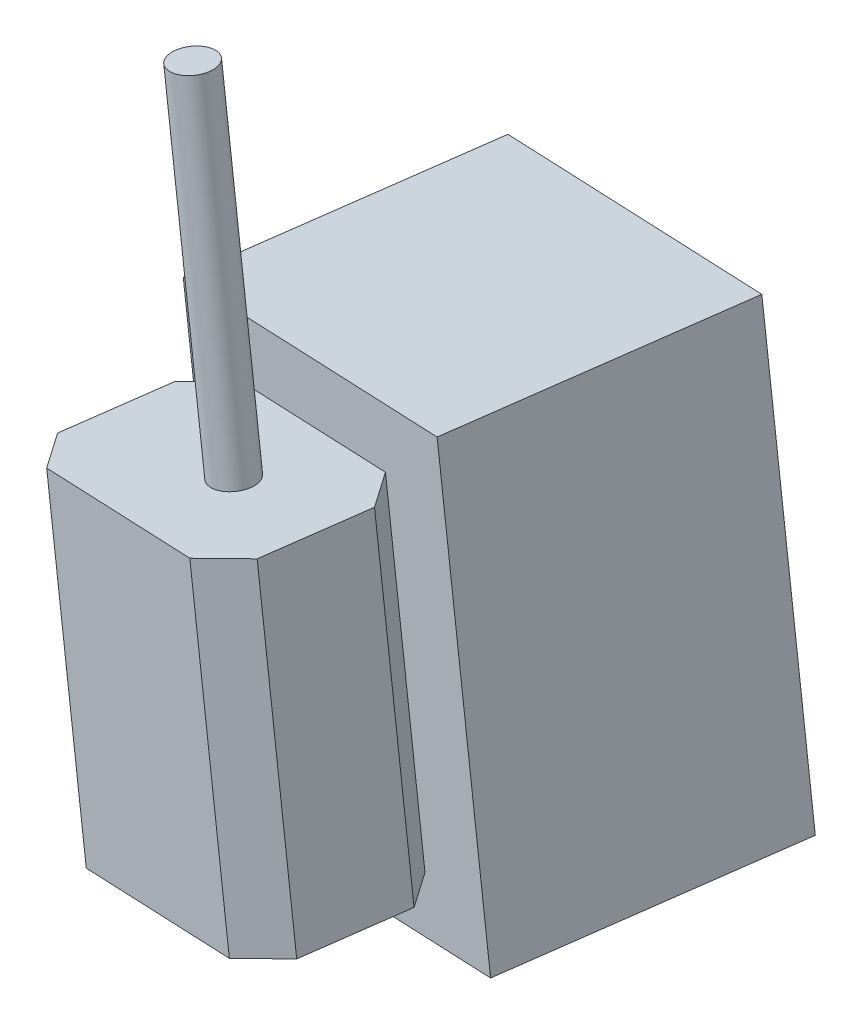
ISO-10303-21;
HEADER;
FILE_DESCRIPTION(('STEP AP214'),'2;1');
FILE_NAME('part.step','',(''),(''),'','','');
FILE_SCHEMA(('AUTOMOTIVE_DESIGN { 1 0 10303 214 1 1 1 1 }'));
ENDSEC;
DATA;
#1=APPLICATION_CONTEXT('core data for automotive mechanical design processes');
#2=APPLICATION_PROTOCOL_DEFINITION('international standard','automotive_design',2000,#1);
#3=PRODUCT_CONTEXT('',#1,'mechanical');
#4=PRODUCT('Part','Part','',(#3));
#5=PRODUCT_RELATED_PRODUCT_CATEGORY('part','',(#4));
#6=PRODUCT_DEFINITION_FORMATION('','',#4);
#7=PRODUCT_DEFINITION_CONTEXT('part definition',#1,'design');
#8=PRODUCT_DEFINITION('design','',#6,#7);
#9=PRODUCT_DEFINITION_SHAPE('','',#8);
#10=(LENGTH_UNIT() NAMED_UNIT(*) SI_UNIT(.MILLI.,.METRE.));
#11=(NAMED_UNIT(*) PLANE_ANGLE_UNIT() SI_UNIT($,.RADIAN.));
#12=(NAMED_UNIT(*) SI_UNIT($,.STERADIAN.) SOLID_ANGLE_UNIT());
#13=UNCERTAINTY_MEASURE_WITH_UNIT(LENGTH_MEASURE(1.E-05),#10,'distance_accuracy_value','');
#14=(GEOMETRIC_REPRESENTATION_CONTEXT(3) GLOBAL_UNCERTAINTY_ASSIGNED_CONTEXT((#13)) GLOBAL_UNIT_ASSIGNED_CONTEXT((#10,
#11,#12)) REPRESENTATION_CONTEXT('',''));
#15=CARTESIAN_POINT('',(0.,0.,0.));
#16=DIRECTION('',(0.,0.,1.));
#17=DIRECTION('',(1.,0.,0.));
#18=AXIS2_PLACEMENT_3D('',#15,#16,#17);
#19=CARTESIAN_POINT('',(103.63472226513,12.5411793974475,-659.097502521401));
#20=DIRECTION('',(-0.155301463699256,-0.0187935421099099,0.987688340595267));
#21=DIRECTION('',(0.987862811204078,0.,0.155328896989503));
#22=AXIS2_PLACEMENT_3D('',#19,#20,#21);
#23=PLANE('',#22);
#24=DIRECTION('',(-0.120136838837569,0.992757341929092,1.46464037480119E-12));
#25=VECTOR('',#24,1.);
#26=CARTESIAN_POINT('',(-916.89912909739,-433.291545399684,-828.046724799583));
#27=LINE('',#26,#25);
#28=CARTESIAN_POINT('',(-916.899129102622,-433.291545397673,-828.046724781075));
#29=VERTEX_POINT('',#28);
#30=CARTESIAN_POINT('',(-948.134707199529,-175.174636494789,-828.046724790618));
#31=VERTEX_POINT('',#30);
#32=EDGE_CURVE('E112',#29,#31,#27,.T.);
#33=ORIENTED_EDGE('',*,*,#32,.T.);
#34=DIRECTION('',(0.980534851673853,0.118657754963437,0.156434465000434));
#35=VECTOR('',#34,1.);
#36=CARTESIAN_POINT('',(-948.134707202459,-175.174636479681,-828.0467248));
#37=LINE('',#36,#35);
#38=CARTESIAN_POINT('',(-771.638433902464,-153.816240593359,-799.888521089255));
#39=VERTEX_POINT('',#38);
#40=EDGE_CURVE('E109',#31,#39,#37,.T.);
#41=ORIENTED_EDGE('',*,*,#40,.T.);
#42=DIRECTION('',(0.120136838837569,-0.992757341929092,-1.46421336594556E-12));
#43=VECTOR('',#42,1.);
#44=CARTESIAN_POINT('',(-771.638433899792,-153.816240599975,-799.888521099967));
#45=LINE('',#44,#43);
#46=CARTESIAN_POINT('',(-740.402855802959,-411.933149499398,-799.888521089009));
#47=VERTEX_POINT('',#46);
#48=EDGE_CURVE('E134',#39,#47,#45,.T.);
#49=ORIENTED_EDGE('',*,*,#48,.T.);
#50=DIRECTION('',(-0.980534851673853,-0.118657754963438,-0.156434465000434));
#51=VECTOR('',#50,1.);
#52=CARTESIAN_POINT('',(-740.402855800458,-411.933149496217,-799.8885211));
#53=LINE('',#52,#51);
#54=EDGE_CURVE('E114',#47,#29,#53,.T.);
#55=ORIENTED_EDGE('',*,*,#54,.T.);
#56=EDGE_LOOP('',(#33,#41,#49,#55));
#57=FACE_BOUND('',#56,.T.);
#58=ADVANCED_FACE('F25',(#57),#23,.F.);
#59=CARTESIAN_POINT('',(-1058.97763977266,-128.150375392334,-168.949222189894));
#60=DIRECTION('',(0.980534851670674,0.118657754996451,0.156434464995321));
#61=DIRECTION('',(0.157547504560289,0.,-0.987511409456532));
#62=AXIS2_PLACEMENT_3D('',#59,#60,#61);
#63=PLANE('',#62);
#64=DIRECTION('',(0.155301463898073,0.0187935421338904,-0.987688340563549));
#65=VECTOR('',#64,1.);
#66=CARTESIAN_POINT('',(-973.913542102792,-178.294218276927,-664.0981436));
#67=LINE('',#66,#65);
#68=CARTESIAN_POINT('',(-973.913542075847,-178.294218291224,-664.0981436105));
#69=VERTEX_POINT('',#68);
#70=EDGE_CURVE('E119',#69,#31,#67,.T.);
#71=ORIENTED_EDGE('',*,*,#70,.T.);
#72=ORIENTED_EDGE('',*,*,#32,.F.);
#73=DIRECTION('',(-0.155301463898073,-0.0187935421338904,0.987688340563549));
#74=VECTOR('',#73,1.);
#75=CARTESIAN_POINT('',(-916.899129101261,-433.291545389576,-828.0467248));
#76=LINE('',#75,#74);
#77=CARTESIAN_POINT('',(-942.677963976808,-436.411127193851,-664.098143610263));
#78=VERTEX_POINT('',#77);
#79=EDGE_CURVE('E140',#29,#78,#76,.T.);
#80=ORIENTED_EDGE('',*,*,#79,.T.);
#81=DIRECTION('',(-0.120136838845713,0.992757341928106,-6.57380133238028E-12));
#82=VECTOR('',#81,1.);
#83=CARTESIAN_POINT('',(-942.677963991393,-436.411127198958,-664.098143654735));
#84=LINE('',#83,#82);
#85=EDGE_CURVE('E130',#78,#69,#84,.T.);
#86=ORIENTED_EDGE('',*,*,#85,.T.);
#87=EDGE_LOOP('',(#71,#72,#80,#86));
#88=FACE_BOUND('',#87,.T.);
#89=ADVANCED_FACE('F129',(#88),#63,.F.);
#90=CARTESIAN_POINT('',(7.20821032848143,-59.5654405179783,0.));
#91=DIRECTION('',(0.120136838804012,-0.992757341933153,0.));
#92=DIRECTION('',(0.992757341933153,0.120136838804012,0.));
#93=AXIS2_PLACEMENT_3D('',#90,#91,#92);
#94=PLANE('',#93);
#95=DIRECTION('',(0.155301463653482,0.0187935421211286,-0.987688340602251));
#96=VECTOR('',#95,1.);
#97=CARTESIAN_POINT('',(-797.417268759525,-156.935822395102,-635.939939893543));
#98=LINE('',#97,#96);
#99=CARTESIAN_POINT('',(-797.417268788932,-156.935822390324,-635.939939910742));
#100=VERTEX_POINT('',#99);
#101=EDGE_CURVE('E126',#100,#39,#98,.T.);
#102=ORIENTED_EDGE('',*,*,#101,.T.);
#103=ORIENTED_EDGE('',*,*,#40,.F.);
#104=ORIENTED_EDGE('',*,*,#70,.F.);
#105=DIRECTION('',(0.980534851663259,0.118657754999587,0.156434465039416));
#106=VECTOR('',#105,1.);
#107=CARTESIAN_POINT('',(-973.913542091125,-178.294218298926,-664.098143656444));
#108=LINE('',#107,#106);
#109=EDGE_CURVE('E143',#69,#100,#108,.T.);
#110=ORIENTED_EDGE('',*,*,#109,.T.);
#111=EDGE_LOOP('',(#102,#103,#104,#110));
#112=FACE_BOUND('',#111,.T.);
#113=ADVANCED_FACE('F123',(#112),#94,.F.);
#114=CARTESIAN_POINT('',(-882.481366477213,-106.791979493612,-140.791018491578));
#115=DIRECTION('',(-0.980534851670674,-0.118657754996451,-0.156434464995321));
#116=DIRECTION('',(-0.157547504560289,0.,0.987511409456532));
#117=AXIS2_PLACEMENT_3D('',#114,#115,#116);
#118=PLANE('',#117);
#119=DIRECTION('',(0.155301463898072,0.0187935421338904,-0.987688340563549));
#120=VECTOR('',#119,1.);
#121=CARTESIAN_POINT('',(-766.181690700791,-415.052731293462,-635.9399399));
#122=LINE('',#121,#120);
#123=CARTESIAN_POINT('',(-766.181690679278,-415.052731295834,-635.939939908891));
#124=VERTEX_POINT('',#123);
#125=EDGE_CURVE('E136',#124,#47,#122,.T.);
#126=ORIENTED_EDGE('',*,*,#125,.T.);
#127=ORIENTED_EDGE('',*,*,#48,.F.);
#128=ORIENTED_EDGE('',*,*,#101,.F.);
#129=DIRECTION('',(0.120136838845713,-0.992757341928106,6.57337432352466E-12));
#130=VECTOR('',#129,1.);
#131=CARTESIAN_POINT('',(-797.417268792228,-156.935822399059,-635.939939949427));
#132=LINE('',#131,#130);
#133=EDGE_CURVE('E145',#100,#124,#132,.T.);
#134=ORIENTED_EDGE('',*,*,#133,.T.);
#135=EDGE_LOOP('',(#126,#127,#128,#134));
#136=FACE_BOUND('',#135,.T.);
#137=ADVANCED_FACE('F273',(#136),#118,.F.);
#138=CARTESIAN_POINT('',(38.4437884185676,-317.682349429218,0.));
#139=DIRECTION('',(-0.120136838804012,0.992757341933153,0.));
#140=DIRECTION('',(-0.992757341933153,-0.120136838804012,0.));
#141=AXIS2_PLACEMENT_3D('',#138,#139,#140);
#142=PLANE('',#141);
#143=ORIENTED_EDGE('',*,*,#79,.F.);
#144=ORIENTED_EDGE('',*,*,#54,.F.);
#145=ORIENTED_EDGE('',*,*,#125,.F.);
#146=DIRECTION('',(-0.980534851663259,-0.118657754999587,-0.156434465039415));
#147=VECTOR('',#146,1.);
#148=CARTESIAN_POINT('',(-766.181690692497,-415.052731299092,-635.939939947718));
#149=LINE('',#148,#147);
#150=EDGE_CURVE('E148',#124,#78,#149,.T.);
#151=ORIENTED_EDGE('',*,*,#150,.T.);
#152=EDGE_LOOP('',(#143,#144,#145,#151));
#153=FACE_BOUND('',#152,.T.);
#154=ADVANCED_FACE('F269',(#153),#142,.F.);
#155=CARTESIAN_POINT('',(34.4880430154643,-284.993830812911,0.));
#156=DIRECTION('',(-0.120136838804012,0.992757341933153,0.));
#157=DIRECTION('',(-0.992757341933153,-0.120136838804012,0.));
#158=AXIS2_PLACEMENT_3D('',#155,#156,#157);
#159=PLANE('',#158);
#160=DIRECTION('',(0.98053485167719,0.118657754884467,0.156434465039415));
#161=VECTOR('',#160,1.);
#162=CARTESIAN_POINT('',(-910.522898389302,-399.352720298705,-658.337027268034));
#163=LINE('',#162,#161);
#164=CARTESIAN_POINT('',(-910.522898419045,-399.352720293857,-658.337027245724));
#165=VERTEX_POINT('',#164);
#166=CARTESIAN_POINT('',(-811.031378604011,-387.312923494248,-642.464156804594));
#167=VERTEX_POINT('',#166);
#168=EDGE_CURVE('E151',#165,#167,#163,.T.);
#169=ORIENTED_EDGE('',*,*,#168,.T.);
#170=DIRECTION('',(0.583528124543153,0.070614663432273,0.809016994367545));
#171=VECTOR('',#170,1.);
#172=CARTESIAN_POINT('',(-811.031378618033,-387.312923502182,-642.464156786802));
#173=LINE('',#172,#171);
#174=CARTESIAN_POINT('',(-794.526710829066,-385.315639210056,-619.58170069288));
#175=VERTEX_POINT('',#174);
#176=EDGE_CURVE('E156',#167,#175,#173,.T.);
#177=ORIENTED_EDGE('',*,*,#176,.T.);
#178=DIRECTION('',(-0.155301463727117,-0.0187935415126332,0.987688340602251));
#179=VECTOR('',#178,1.);
#180=CARTESIAN_POINT('',(-794.526710866065,-385.315639207995,-619.58170071054));
#181=LINE('',#180,#179);
#182=CARTESIAN_POINT('',(-803.844798691422,-386.44325171124,-560.320400189304));
#183=VERTEX_POINT('',#182);
#184=EDGE_CURVE('E159',#175,#183,#181,.T.);
#185=ORIENTED_EDGE('',*,*,#184,.T.);
#186=DIRECTION('',(-0.803157560668491,-0.0971927463146037,0.587785252285956));
#187=VECTOR('',#186,1.);
#188=CARTESIAN_POINT('',(-803.844798668829,-386.443251696228,-560.320400156784));
#189=LINE('',#188,#187);
#190=CARTESIAN_POINT('',(-826.56152497985,-389.19227769498,-543.695322689953));
#191=VERTEX_POINT('',#190);
#192=EDGE_CURVE('E167',#183,#191,#189,.T.);
#193=ORIENTED_EDGE('',*,*,#192,.T.);
#194=DIRECTION('',(-0.980534851662966,-0.11865775500201,-0.156434465039415));
#195=VECTOR('',#194,1.);
#196=CARTESIAN_POINT('',(-826.561524990541,-389.192277698855,-543.695322760152));
#197=LINE('',#196,#195);
#198=CARTESIAN_POINT('',(-926.053044713327,-401.232074498019,-559.568193190342));
#199=VERTEX_POINT('',#198);
#200=EDGE_CURVE('E172',#191,#199,#197,.T.);
#201=ORIENTED_EDGE('',*,*,#200,.T.);
#202=DIRECTION('',(-0.583528124964828,-0.0706146599477659,-0.809016994367543));
#203=VECTOR('',#202,1.);
#204=CARTESIAN_POINT('',(-926.053044751439,-401.232074506225,-559.568193162354));
#205=LINE('',#204,#203);
#206=CARTESIAN_POINT('',(-942.557712507996,-403.229358712868,-582.450649290824));
#207=VERTEX_POINT('',#206);
#208=EDGE_CURVE('E177',#199,#207,#205,.T.);
#209=ORIENTED_EDGE('',*,*,#208,.T.);
#210=DIRECTION('',(0.155301463703063,0.0187935417114061,-0.987688340602251));
#211=VECTOR('',#210,1.);
#212=CARTESIAN_POINT('',(-942.557712489745,-403.229358698759,-582.450649298364));
#213=LINE('',#212,#211);
#214=CARTESIAN_POINT('',(-933.239624712489,-402.101746213345,-641.711949727354));
#215=VERTEX_POINT('',#214);
#216=EDGE_CURVE('E182',#207,#215,#213,.T.);
#217=ORIENTED_EDGE('',*,*,#216,.T.);
#218=DIRECTION('',(0.803157561090161,0.0971927428300976,-0.587785252285957));
#219=VECTOR('',#218,1.);
#220=CARTESIAN_POINT('',(-933.239624781953,-402.101746209918,-641.711949813622));
#221=LINE('',#220,#219);
#222=EDGE_CURVE('E185',#215,#165,#221,.T.);
#223=ORIENTED_EDGE('',*,*,#222,.T.);
#224=EDGE_LOOP('',(#169,#177,#185,#193,#201,#209,#217,#223));
#225=FACE_BOUND('',#224,.T.);
#226=ADVANCED_FACE('F265',(#225),#159,.F.);
#227=CARTESIAN_POINT('',(77.8558874123235,9.42159760594014,-495.148921408512));
#228=DIRECTION('',(-0.155301463699256,-0.0187935421099099,0.987688340595267));
#229=DIRECTION('',(0.987862811204078,0.,0.155328896989503));
#230=AXIS2_PLACEMENT_3D('',#227,#228,#229);
#231=PLANE('',#230);
#232=DIRECTION('',(0.12013683883695,-0.992757341929167,-3.00419347845317E-12));
#233=VECTOR('',#232,1.);
#234=CARTESIAN_POINT('',(-834.135838418822,-196.387955602278,-642.464156786225));
#235=LINE('',#234,#233);
#236=CARTESIAN_POINT('',(-834.135838403622,-196.387955598558,-642.464156804873));
#237=VERTEX_POINT('',#236);
#238=EDGE_CURVE('E153',#237,#167,#235,.T.);
#239=ORIENTED_EDGE('',*,*,#238,.T.);
#240=ORIENTED_EDGE('',*,*,#168,.F.);
#241=DIRECTION('',(-0.12013683883051,0.992757341929946,3.23972594179077E-12));
#242=VECTOR('',#241,1.);
#243=CARTESIAN_POINT('',(-910.522898482848,-399.352720310026,-658.337027314862));
#244=LINE('',#243,#242);
#245=CARTESIAN_POINT('',(-933.627358215168,-208.427752401969,-658.337027263001));
#246=VERTEX_POINT('',#245);
#247=EDGE_CURVE('E188',#165,#246,#244,.T.);
#248=ORIENTED_EDGE('',*,*,#247,.T.);
#249=DIRECTION('',(0.980534851748689,0.118657754972493,0.156434464524487));
#250=VECTOR('',#249,1.);
#251=CARTESIAN_POINT('',(-933.627358199937,-208.427752400524,-658.3370272));
#252=LINE('',#251,#250);
#253=EDGE_CURVE('E192',#246,#237,#252,.T.);
#254=ORIENTED_EDGE('',*,*,#253,.T.);
#255=EDGE_LOOP('',(#239,#240,#248,#254));
#256=FACE_BOUND('',#255,.T.);
#257=ORIENTED_EDGE('',*,*,#133,.F.);
#258=ORIENTED_EDGE('',*,*,#109,.F.);
#259=ORIENTED_EDGE('',*,*,#85,.F.);
#260=ORIENTED_EDGE('',*,*,#150,.F.);
#261=EDGE_LOOP('',(#257,#258,#259,#260));
#262=FACE_BOUND('',#261,.T.);
#263=ADVANCED_FACE('F261',(#256,#262),#231,.T.);
#264=CARTESIAN_POINT('',(-250.10248805411,-30.2657266097262,183.035759355874));
#265=DIRECTION('',(-0.803157560903636,-0.0971927442704401,0.587785252302661));
#266=DIRECTION('',(0.590581313552521,0.,0.806978136062297));
#267=AXIS2_PLACEMENT_3D('',#264,#265,#266);
#268=PLANE('',#267);
#269=ORIENTED_EDGE('',*,*,#176,.F.);
#270=ORIENTED_EDGE('',*,*,#238,.F.);
#271=DIRECTION('',(0.583528125675088,0.0706146622248362,0.809016993656494));
#272=VECTOR('',#271,1.);
#273=CARTESIAN_POINT('',(-834.135838400897,-196.387955592587,-642.4641568));
#274=LINE('',#273,#272);
#275=CARTESIAN_POINT('',(-817.631170639042,-194.390671387351,-619.581700685261));
#276=VERTEX_POINT('',#275);
#277=EDGE_CURVE('E195',#237,#276,#274,.T.);
#278=ORIENTED_EDGE('',*,*,#277,.T.);
#279=DIRECTION('',(0.120136838838746,-0.992757341928949,-8.95254275324776E-12));
#280=VECTOR('',#279,1.);
#281=CARTESIAN_POINT('',(-817.631170655273,-194.390671406689,-619.581700708818));
#282=LINE('',#281,#280);
#283=EDGE_CURVE('E161',#276,#175,#282,.T.);
#284=ORIENTED_EDGE('',*,*,#283,.T.);
#285=EDGE_LOOP('',(#269,#270,#278,#284));
#286=FACE_BOUND('',#285,.T.);
#287=ADVANCED_FACE('F257',(#286),#268,.F.);
#288=CARTESIAN_POINT('',(-903.764612009869,-109.367535201439,-144.18654606777));
#289=DIRECTION('',(-0.980534851670674,-0.118657754996451,-0.156434464995321));
#290=DIRECTION('',(-0.157547504560289,0.,0.987511409456532));
#291=AXIS2_PLACEMENT_3D('',#288,#289,#290);
#292=PLANE('',#291);
#293=DIRECTION('',(-0.155301463131534,-0.0187935420411293,0.987688340685843));
#294=VECTOR('',#293,1.);
#295=CARTESIAN_POINT('',(-817.631170608289,-194.390671331507,-619.5817007));
#296=LINE('',#295,#294);
#297=CARTESIAN_POINT('',(-826.949258444291,-195.518283893969,-560.320400206331));
#298=VERTEX_POINT('',#297);
#299=EDGE_CURVE('E198',#276,#298,#296,.T.);
#300=ORIENTED_EDGE('',*,*,#299,.T.);
#301=DIRECTION('',(0.120136838535684,-0.992757341965624,2.12526483732818E-10));
#302=VECTOR('',#301,1.);
#303=CARTESIAN_POINT('',(-826.949258398309,-195.518283899795,-560.320400197656));
#304=LINE('',#303,#302);
#305=EDGE_CURVE('E164',#298,#183,#304,.T.);
#306=ORIENTED_EDGE('',*,*,#305,.T.);
#307=ORIENTED_EDGE('',*,*,#184,.F.);
#308=ORIENTED_EDGE('',*,*,#283,.F.);
#309=EDGE_LOOP('',(#300,#306,#307,#308));
#310=FACE_BOUND('',#309,.T.);
#311=ADVANCED_FACE('F253',(#310),#292,.F.);
#312=CARTESIAN_POINT('',(-554.155264124123,-67.0601554265484,-768.293775802365));
#313=DIRECTION('',(0.583528124685345,0.0706146621182265,0.809016994379682));
#314=DIRECTION('',(0.811041622795911,0.,-0.584988449537745));
#315=AXIS2_PLACEMENT_3D('',#312,#313,#314);
#316=PLANE('',#315);
#317=DIRECTION('',(0.120136838832154,-0.992757341929747,4.40988354763716E-12));
#318=VECTOR('',#317,1.);
#319=CARTESIAN_POINT('',(-849.665984790408,-198.267309798839,-543.695322761));
#320=LINE('',#319,#318);
#321=CARTESIAN_POINT('',(-849.665984779073,-198.267309799243,-543.695322689854));
#322=VERTEX_POINT('',#321);
#323=EDGE_CURVE('E169',#322,#191,#320,.T.);
#324=ORIENTED_EDGE('',*,*,#323,.T.);
#325=ORIENTED_EDGE('',*,*,#192,.F.);
#326=ORIENTED_EDGE('',*,*,#305,.F.);
#327=DIRECTION('',(-0.803157562154612,-0.0971927443930087,0.587785250573044));
#328=VECTOR('',#327,1.);
#329=CARTESIAN_POINT('',(-826.949258405434,-195.518283855094,-560.3204002));
#330=LINE('',#329,#328);
#331=EDGE_CURVE('E201',#298,#322,#330,.T.);
#332=ORIENTED_EDGE('',*,*,#331,.T.);
#333=EDGE_LOOP('',(#324,#325,#326,#332));
#334=FACE_BOUND('',#333,.T.);
#335=ADVANCED_FACE('F249',(#334),#316,.T.);
#336=CARTESIAN_POINT('',(62.3257410424723,7.54224339495815,-396.380087349459));
#337=DIRECTION('',(-0.155301463699256,-0.0187935421099099,0.987688340595267));
#338=DIRECTION('',(0.987862811204078,0.,0.155328896989503));
#339=AXIS2_PLACEMENT_3D('',#336,#337,#338);
#340=PLANE('',#339);
#341=ORIENTED_EDGE('',*,*,#323,.F.);
#342=DIRECTION('',(-0.980534851573747,-0.118657754951323,-0.156434465637087));
#343=VECTOR('',#342,1.);
#344=CARTESIAN_POINT('',(-849.665984799153,-198.267309806998,-543.6953227));
#345=LINE('',#344,#343);
#346=CARTESIAN_POINT('',(-949.157504512938,-210.307106602329,-559.568193190622));
#347=VERTEX_POINT('',#346);
#348=EDGE_CURVE('E204',#322,#347,#345,.T.);
#349=ORIENTED_EDGE('',*,*,#348,.T.);
#350=DIRECTION('',(0.120136838836951,-0.992757341929167,-3.00361619300381E-12));
#351=VECTOR('',#350,1.);
#352=CARTESIAN_POINT('',(-949.157504552228,-210.30710660632,-559.568193161777));
#353=LINE('',#352,#351);
#354=EDGE_CURVE('E174',#347,#199,#353,.T.);
#355=ORIENTED_EDGE('',*,*,#354,.T.);
#356=ORIENTED_EDGE('',*,*,#200,.F.);
#357=EDGE_LOOP('',(#341,#349,#355,#356));
#358=FACE_BOUND('',#357,.T.);
#359=ADVANCED_FACE('F245',(#358),#340,.T.);
#360=CARTESIAN_POINT('',(-364.519018045289,-44.1116481089051,266.77069783145));
#361=DIRECTION('',(-0.803157560903636,-0.0971927442704401,0.587785252302661));
#362=DIRECTION('',(0.590581313552521,0.,0.806978136062297));
#363=AXIS2_PLACEMENT_3D('',#360,#361,#362);
#364=PLANE('',#363);
#365=ORIENTED_EDGE('',*,*,#354,.F.);
#366=DIRECTION('',(-0.583528125951069,-0.0706146622582327,-0.809016993454519));
#367=VECTOR('',#366,1.);
#368=CARTESIAN_POINT('',(-949.157504499636,-210.307106603009,-559.5681932));
#369=LINE('',#368,#367);
#370=CARTESIAN_POINT('',(-965.662172304252,-212.304390891771,-582.450649292961));
#371=VERTEX_POINT('',#370);
#372=EDGE_CURVE('E207',#347,#371,#369,.T.);
#373=ORIENTED_EDGE('',*,*,#372,.T.);
#374=DIRECTION('',(0.120136838838746,-0.992757341928949,-8.95254275324776E-12));
#375=VECTOR('',#374,1.);
#376=CARTESIAN_POINT('',(-965.662172278953,-212.304390897453,-582.450649296642));
#377=LINE('',#376,#375);
#378=EDGE_CURVE('E179',#371,#207,#377,.T.);
#379=ORIENTED_EDGE('',*,*,#378,.T.);
#380=ORIENTED_EDGE('',*,*,#208,.F.);
#381=EDGE_LOOP('',(#365,#373,#379,#380));
#382=FACE_BOUND('',#381,.T.);
#383=ADVANCED_FACE('F241',(#382),#364,.T.);
#384=CARTESIAN_POINT('',(-1042.47752580734,-126.153642204346,-166.316795105708));
#385=DIRECTION('',(0.980534851670674,0.118657754996451,0.156434464995321));
#386=DIRECTION('',(0.157547504560289,0.,-0.987511409456532));
#387=AXIS2_PLACEMENT_3D('',#384,#385,#386);
#388=PLANE('',#387);
#389=ORIENTED_EDGE('',*,*,#216,.F.);
#390=ORIENTED_EDGE('',*,*,#378,.F.);
#391=DIRECTION('',(0.155301463387187,0.0187935420720662,-0.987688340645056));
#392=VECTOR('',#391,1.);
#393=CARTESIAN_POINT('',(-965.662172304171,-212.304390865532,-582.4506493));
#394=LINE('',#393,#392);
#395=CARTESIAN_POINT('',(-956.344084502529,-211.17677838558,-641.711949723858));
#396=VERTEX_POINT('',#395);
#397=EDGE_CURVE('E210',#371,#396,#394,.T.);
#398=ORIENTED_EDGE('',*,*,#397,.T.);
#399=DIRECTION('',(0.1201368388711,-0.992757341925034,-3.29451033263539E-11));
#400=VECTOR('',#399,1.);
#401=CARTESIAN_POINT('',(-956.344084577383,-211.176778409364,-641.711949807286));
#402=LINE('',#401,#400);
#403=EDGE_CURVE('E41',#396,#215,#402,.T.);
#404=ORIENTED_EDGE('',*,*,#403,.T.);
#405=EDGE_LOOP('',(#389,#390,#398,#404));
#406=FACE_BOUND('',#405,.T.);
#407=ADVANCED_FACE('F238',(#406),#388,.F.);
#408=CARTESIAN_POINT('',(-637.283739183728,-77.1198062478395,-883.545031388978));
#409=DIRECTION('',(0.583528124685345,0.0706146621182265,0.809016994379682));
#410=DIRECTION('',(0.811041622795911,0.,-0.584988449537745));
#411=AXIS2_PLACEMENT_3D('',#408,#409,#410);
#412=PLANE('',#411);
#413=DIRECTION('',(0.803157561096428,0.0971927442649551,-0.587785252040135));
#414=VECTOR('',#413,1.);
#415=CARTESIAN_POINT('',(-956.344084507026,-211.176778341944,-641.7119497));
#416=LINE('',#415,#414);
#417=EDGE_CURVE('E213',#396,#246,#416,.T.);
#418=ORIENTED_EDGE('',*,*,#417,.T.);
#419=ORIENTED_EDGE('',*,*,#247,.F.);
#420=ORIENTED_EDGE('',*,*,#222,.F.);
#421=ORIENTED_EDGE('',*,*,#403,.F.);
#422=EDGE_LOOP('',(#418,#419,#420,#421));
#423=FACE_BOUND('',#422,.T.);
#424=ADVANCED_FACE('F235',(#423),#412,.F.);
#425=CARTESIAN_POINT('',(-12.6437845409194,104.482605483701,0.));
#426=DIRECTION('',(-0.120136838804012,0.992757341933153,0.));
#427=DIRECTION('',(-0.992757341933153,-0.120136838804012,0.));
#428=AXIS2_PLACEMENT_3D('',#425,#426,#427);
#429=PLANE('',#428);
#430=CARTESIAN_POINT('',(-905.874982806354,-3.61024701581558,-601.544037));
#431=DIRECTION('',(-0.120136805561399,0.992757345955951,0.));
#432=DIRECTION('',(-0.99275734595595,-0.120136805561399,0.));
#433=AXIS2_PLACEMENT_3D('',#430,#431,#432);
#434=CIRCLE('',#433,12.0000000001715);
#435=CARTESIAN_POINT('',(-917.788070957995,-5.05188868257297,-601.544037));
#436=VERTEX_POINT('',#435);
#437=EDGE_CURVE('E28',#436,#436,#434,.T.);
#438=ORIENTED_EDGE('',*,*,#437,.T.);
#439=EDGE_LOOP('',(#438));
#440=FACE_BOUND('',#439,.T.);
#441=ADVANCED_FACE('F218',(#440),#429,.T.);
#442=CARTESIAN_POINT('',(11.3835832230882,-94.068862929415,0.));
#443=DIRECTION('',(0.120136838804012,-0.992757341933153,0.));
#444=DIRECTION('',(0.992757341933153,0.120136838804012,0.));
#445=AXIS2_PLACEMENT_3D('',#442,#443,#444);
#446=PLANE('',#445);
#447=CARTESIAN_POINT('',(-881.847621791054,-202.161715405609,-601.544037));
#448=DIRECTION('',(-0.120136805561399,0.992757345955951,0.));
#449=DIRECTION('',(-0.99275734595595,-0.120136805561399,0.));
#450=AXIS2_PLACEMENT_3D('',#447,#448,#449);
#451=CIRCLE('',#450,12.0000000001715);
#452=CARTESIAN_POINT('',(-893.760709942695,-203.603357072367,-601.544037));
#453=VERTEX_POINT('',#452);
#454=EDGE_CURVE('E13',#453,#453,#451,.F.);
#455=ORIENTED_EDGE('',*,*,#454,.T.);
#456=EDGE_LOOP('',(#455));
#457=FACE_BOUND('',#456,.T.);
#458=ORIENTED_EDGE('',*,*,#397,.F.);
#459=ORIENTED_EDGE('',*,*,#372,.F.);
#460=ORIENTED_EDGE('',*,*,#348,.F.);
#461=ORIENTED_EDGE('',*,*,#331,.F.);
#462=ORIENTED_EDGE('',*,*,#299,.F.);
#463=ORIENTED_EDGE('',*,*,#277,.F.);
#464=ORIENTED_EDGE('',*,*,#253,.F.);
#465=ORIENTED_EDGE('',*,*,#417,.F.);
#466=EDGE_LOOP('',(#458,#459,#460,#461,#462,#463,#464,#465));
#467=FACE_BOUND('',#466,.T.);
#468=ADVANCED_FACE('F222',(#457,#467),#446,.F.);
#469=CARTESIAN_POINT('',(-881.847621690363,-202.16171623767,-601.544037));
#470=DIRECTION('',(-0.120136805561399,0.992757345955951,0.));
#471=DIRECTION('',(-0.99275734595595,-0.120136805561399,0.));
#472=AXIS2_PLACEMENT_3D('',#469,#470,#471);
#473=CYLINDRICAL_SURFACE('',#472,12.0000000001715);
#474=ORIENTED_EDGE('',*,*,#454,.F.);
#475=EDGE_LOOP('',(#474));
#476=FACE_BOUND('',#475,.T.);
#477=ORIENTED_EDGE('',*,*,#437,.F.);
#478=EDGE_LOOP('',(#477));
#479=FACE_BOUND('',#478,.T.);
#480=ADVANCED_FACE('F220',(#476,#479),#473,.T.);
#481=CLOSED_SHELL('',(#58,#89,#113,#137,#154,#226,#263,#287,#311,#335,#359,#383,#407,#424,#441,
#468,#480));
#482=MANIFOLD_SOLID_BREP('B1',#481);
#483=ADVANCED_BREP_SHAPE_REPRESENTATION('',(#18,#482),#14);
#484=SHAPE_DEFINITION_REPRESENTATION(#9,#483);
ENDSEC;
END-ISO-10303-21;
